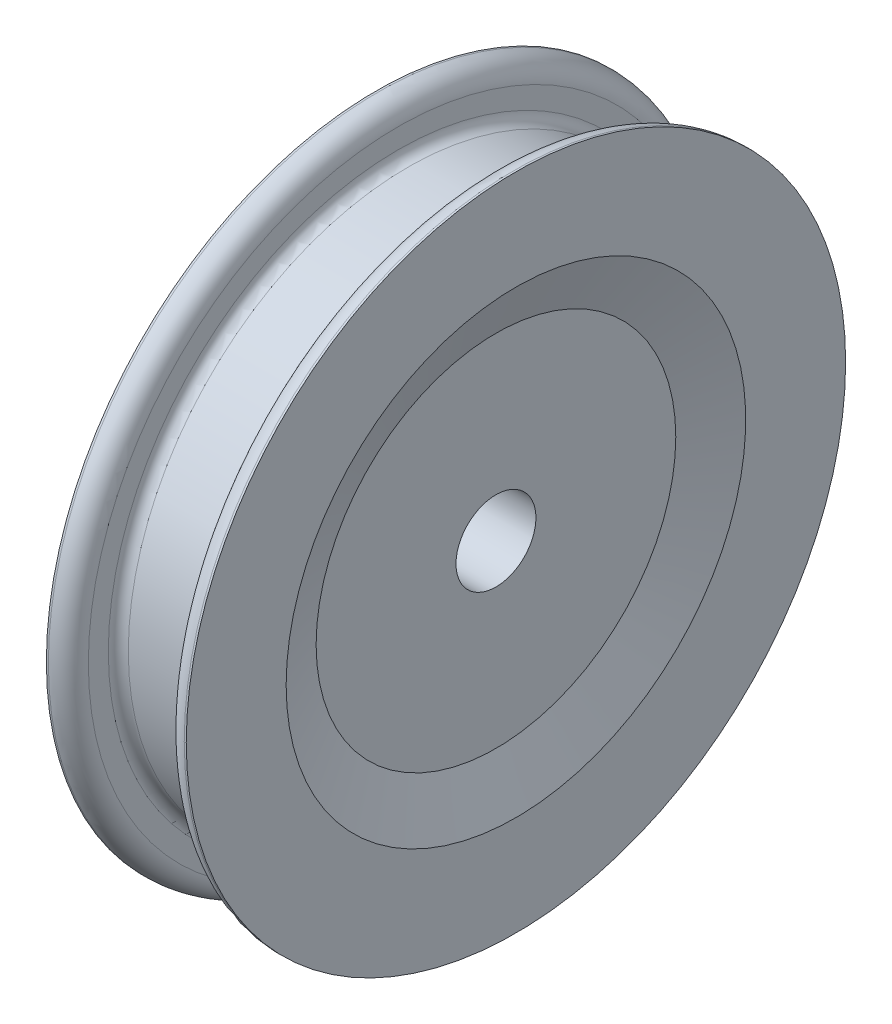
ISO-10303-21;
HEADER;
FILE_DESCRIPTION(('STEP AP214'),'2;1');
FILE_NAME('part.step','',(''),(''),'','','');
FILE_SCHEMA(('AUTOMOTIVE_DESIGN { 1 0 10303 214 1 1 1 1 }'));
ENDSEC;
DATA;
#1=APPLICATION_CONTEXT('core data for automotive mechanical design processes');
#2=APPLICATION_PROTOCOL_DEFINITION('international standard','automotive_design',2000,#1);
#3=PRODUCT_CONTEXT('',#1,'mechanical');
#4=PRODUCT('Part','Part','',(#3));
#5=PRODUCT_RELATED_PRODUCT_CATEGORY('part','',(#4));
#6=PRODUCT_DEFINITION_FORMATION('','',#4);
#7=PRODUCT_DEFINITION_CONTEXT('part definition',#1,'design');
#8=PRODUCT_DEFINITION('design','',#6,#7);
#9=PRODUCT_DEFINITION_SHAPE('','',#8);
#10=(LENGTH_UNIT() NAMED_UNIT(*) SI_UNIT(.MILLI.,.METRE.));
#11=(NAMED_UNIT(*) PLANE_ANGLE_UNIT() SI_UNIT($,.RADIAN.));
#12=(NAMED_UNIT(*) SI_UNIT($,.STERADIAN.) SOLID_ANGLE_UNIT());
#13=UNCERTAINTY_MEASURE_WITH_UNIT(LENGTH_MEASURE(1.E-05),#10,'distance_accuracy_value','');
#14=(GEOMETRIC_REPRESENTATION_CONTEXT(3) GLOBAL_UNCERTAINTY_ASSIGNED_CONTEXT((#13)) GLOBAL_UNIT_ASSIGNED_CONTEXT((#10,
#11,#12)) REPRESENTATION_CONTEXT('',''));
#15=CARTESIAN_POINT('',(0.,0.,0.));
#16=DIRECTION('',(0.,0.,1.));
#17=DIRECTION('',(1.,0.,0.));
#18=AXIS2_PLACEMENT_3D('',#15,#16,#17);
#19=CARTESIAN_POINT('',(0.,0.,0.));
#20=DIRECTION('',(-1.,0.,0.));
#21=DIRECTION('',(0.,0.,1.));
#22=AXIS2_PLACEMENT_3D('',#19,#20,#21);
#23=CYLINDRICAL_SURFACE('',#22,1.);
#24=CARTESIAN_POINT('',(1.25,0.,0.));
#25=DIRECTION('',(-1.,0.,0.));
#26=DIRECTION('',(0.,0.,1.));
#27=AXIS2_PLACEMENT_3D('',#24,#25,#26);
#28=CIRCLE('',#27,1.);
#29=CARTESIAN_POINT('',(1.25,0.,1.));
#30=VERTEX_POINT('',#29);
#31=EDGE_CURVE('E50',#30,#30,#28,.T.);
#32=ORIENTED_EDGE('',*,*,#31,.F.);
#33=EDGE_LOOP('',(#32));
#34=FACE_BOUND('',#33,.T.);
#35=CARTESIAN_POINT('',(-1.75,0.,0.));
#36=DIRECTION('',(-1.,0.,0.));
#37=DIRECTION('',(0.,0.,1.));
#38=AXIS2_PLACEMENT_3D('',#35,#36,#37);
#39=CIRCLE('',#38,1.);
#40=CARTESIAN_POINT('',(-1.75,0.,1.));
#41=VERTEX_POINT('',#40);
#42=EDGE_CURVE('E77',#41,#41,#39,.T.);
#43=ORIENTED_EDGE('',*,*,#42,.T.);
#44=EDGE_LOOP('',(#43));
#45=FACE_BOUND('',#44,.T.);
#46=ADVANCED_FACE('F30',(#34,#45),#23,.F.);
#47=CARTESIAN_POINT('',(1.25,4.5,0.));
#48=DIRECTION('',(-1.,0.,0.));
#49=DIRECTION('',(0.,0.,1.));
#50=AXIS2_PLACEMENT_3D('',#47,#48,#49);
#51=PLANE('',#50);
#52=CARTESIAN_POINT('',(1.25,0.,0.));
#53=DIRECTION('',(-1.,0.,0.));
#54=DIRECTION('',(0.,0.,1.));
#55=AXIS2_PLACEMENT_3D('',#52,#53,#54);
#56=CIRCLE('',#55,4.5);
#57=CARTESIAN_POINT('',(1.25,0.,4.5));
#58=VERTEX_POINT('',#57);
#59=EDGE_CURVE('E53',#58,#58,#56,.T.);
#60=ORIENTED_EDGE('',*,*,#59,.F.);
#61=EDGE_LOOP('',(#60));
#62=FACE_BOUND('',#61,.T.);
#63=ORIENTED_EDGE('',*,*,#31,.T.);
#64=EDGE_LOOP('',(#63));
#65=FACE_BOUND('',#64,.T.);
#66=ADVANCED_FACE('F101',(#62,#65),#51,.F.);
#67=CARTESIAN_POINT('',(1.25,0.,0.));
#68=DIRECTION('',(1.,0.,0.));
#69=DIRECTION('',(0.,0.,-1.));
#70=AXIS2_PLACEMENT_3D('',#67,#68,#69);
#71=CONICAL_SURFACE('',#70,4.5,1.19028994968253);
#72=CARTESIAN_POINT('',(1.75,0.,0.));
#73=DIRECTION('',(-1.,0.,0.));
#74=DIRECTION('',(0.,0.,1.));
#75=AXIS2_PLACEMENT_3D('',#72,#73,#74);
#76=CIRCLE('',#75,5.74999999999999);
#77=CARTESIAN_POINT('',(1.75,0.,5.74999999999999));
#78=VERTEX_POINT('',#77);
#79=EDGE_CURVE('E56',#78,#78,#76,.T.);
#80=ORIENTED_EDGE('',*,*,#79,.F.);
#81=EDGE_LOOP('',(#80));
#82=FACE_BOUND('',#81,.T.);
#83=ORIENTED_EDGE('',*,*,#59,.T.);
#84=EDGE_LOOP('',(#83));
#85=FACE_BOUND('',#84,.T.);
#86=ADVANCED_FACE('F107',(#82,#85),#71,.F.);
#87=CARTESIAN_POINT('',(1.75,8.24999999999999,0.));
#88=DIRECTION('',(-1.,0.,0.));
#89=DIRECTION('',(0.,0.,1.));
#90=AXIS2_PLACEMENT_3D('',#87,#88,#89);
#91=PLANE('',#90);
#92=CARTESIAN_POINT('',(1.75,0.,0.));
#93=DIRECTION('',(-1.,0.,0.));
#94=DIRECTION('',(0.,0.,1.));
#95=AXIS2_PLACEMENT_3D('',#92,#93,#94);
#96=CIRCLE('',#95,8.24999999999999);
#97=CARTESIAN_POINT('',(1.75,0.,8.24999999999999));
#98=VERTEX_POINT('',#97);
#99=EDGE_CURVE('E59',#98,#98,#96,.T.);
#100=ORIENTED_EDGE('',*,*,#99,.F.);
#101=EDGE_LOOP('',(#100));
#102=FACE_BOUND('',#101,.T.);
#103=ORIENTED_EDGE('',*,*,#79,.T.);
#104=EDGE_LOOP('',(#103));
#105=FACE_BOUND('',#104,.T.);
#106=ADVANCED_FACE('F148',(#102,#105),#91,.F.);
#107=CARTESIAN_POINT('',(0.,0.,0.));
#108=DIRECTION('',(-1.,0.,0.));
#109=DIRECTION('',(0.,0.,1.));
#110=AXIS2_PLACEMENT_3D('',#107,#108,#109);
#111=CYLINDRICAL_SURFACE('',#110,8.24999999999999);
#112=CARTESIAN_POINT('',(1.7,0.,0.));
#113=DIRECTION('',(1.,0.,0.));
#114=DIRECTION('',(0.,0.,-1.));
#115=AXIS2_PLACEMENT_3D('',#112,#113,#114);
#116=CIRCLE('',#115,8.24999999999999);
#117=CARTESIAN_POINT('',(1.7,0.,-8.24999999999999));
#118=VERTEX_POINT('',#117);
#119=EDGE_CURVE('E10',#118,#118,#116,.T.);
#120=ORIENTED_EDGE('',*,*,#119,.T.);
#121=EDGE_LOOP('',(#120));
#122=FACE_BOUND('',#121,.T.);
#123=ORIENTED_EDGE('',*,*,#99,.T.);
#124=EDGE_LOOP('',(#123));
#125=FACE_BOUND('',#124,.T.);
#126=ADVANCED_FACE('F143',(#122,#125),#111,.T.);
#127=CARTESIAN_POINT('',(1.2,8.24999999999999,0.));
#128=DIRECTION('',(1.,0.,0.));
#129=DIRECTION('',(0.,0.,-1.));
#130=AXIS2_PLACEMENT_3D('',#127,#128,#129);
#131=PLANE('',#130);
#132=CARTESIAN_POINT('',(1.2,0.,0.));
#133=DIRECTION('',(1.,0.,0.));
#134=DIRECTION('',(0.,0.,-1.));
#135=AXIS2_PLACEMENT_3D('',#132,#133,#134);
#136=CIRCLE('',#135,7.74999999999999);
#137=CARTESIAN_POINT('',(1.2,0.,-7.74999999999999));
#138=VERTEX_POINT('',#137);
#139=EDGE_CURVE('E37',#138,#138,#136,.F.);
#140=ORIENTED_EDGE('',*,*,#139,.T.);
#141=EDGE_LOOP('',(#140));
#142=FACE_BOUND('',#141,.T.);
#143=CARTESIAN_POINT('',(1.2,0.,0.));
#144=DIRECTION('',(-1.,0.,0.));
#145=DIRECTION('',(0.,0.,1.));
#146=AXIS2_PLACEMENT_3D('',#143,#144,#145);
#147=CIRCLE('',#146,7.25);
#148=CARTESIAN_POINT('',(1.2,0.,7.25));
#149=VERTEX_POINT('',#148);
#150=EDGE_CURVE('E62',#149,#149,#147,.T.);
#151=ORIENTED_EDGE('',*,*,#150,.F.);
#152=EDGE_LOOP('',(#151));
#153=FACE_BOUND('',#152,.T.);
#154=ADVANCED_FACE('F138',(#142,#153),#131,.F.);
#155=CARTESIAN_POINT('',(0.95,0.,0.));
#156=DIRECTION('',(-1.,0.,0.));
#157=DIRECTION('',(0.,0.,1.));
#158=AXIS2_PLACEMENT_3D('',#155,#156,#157);
#159=TOROIDAL_SURFACE('',#158,7.25,0.25);
#160=CARTESIAN_POINT('',(0.95,0.,0.));
#161=DIRECTION('',(-1.,0.,0.));
#162=DIRECTION('',(0.,0.,1.));
#163=AXIS2_PLACEMENT_3D('',#160,#161,#162);
#164=CIRCLE('',#163,7.);
#165=CARTESIAN_POINT('',(0.95,0.,7.));
#166=VERTEX_POINT('',#165);
#167=EDGE_CURVE('E65',#166,#166,#164,.T.);
#168=ORIENTED_EDGE('',*,*,#167,.F.);
#169=EDGE_LOOP('',(#168));
#170=FACE_BOUND('',#169,.T.);
#171=ORIENTED_EDGE('',*,*,#150,.T.);
#172=EDGE_LOOP('',(#171));
#173=FACE_BOUND('',#172,.T.);
#174=ADVANCED_FACE('F132',(#170,#173),#159,.F.);
#175=CARTESIAN_POINT('',(0.,0.,0.));
#176=DIRECTION('',(-1.,0.,0.));
#177=DIRECTION('',(0.,0.,1.));
#178=AXIS2_PLACEMENT_3D('',#175,#176,#177);
#179=CYLINDRICAL_SURFACE('',#178,7.);
#180=CARTESIAN_POINT('',(-0.95,0.,0.));
#181=DIRECTION('',(-1.,0.,0.));
#182=DIRECTION('',(0.,0.,1.));
#183=AXIS2_PLACEMENT_3D('',#180,#181,#182);
#184=CIRCLE('',#183,7.);
#185=CARTESIAN_POINT('',(-0.95,0.,7.));
#186=VERTEX_POINT('',#185);
#187=EDGE_CURVE('E68',#186,#186,#184,.T.);
#188=ORIENTED_EDGE('',*,*,#187,.F.);
#189=EDGE_LOOP('',(#188));
#190=FACE_BOUND('',#189,.T.);
#191=ORIENTED_EDGE('',*,*,#167,.T.);
#192=EDGE_LOOP('',(#191));
#193=FACE_BOUND('',#192,.T.);
#194=ADVANCED_FACE('F126',(#190,#193),#179,.T.);
#195=CARTESIAN_POINT('',(-0.95,0.,0.));
#196=DIRECTION('',(-1.,0.,0.));
#197=DIRECTION('',(0.,0.,1.));
#198=AXIS2_PLACEMENT_3D('',#195,#196,#197);
#199=TOROIDAL_SURFACE('',#198,7.25,0.25);
#200=CARTESIAN_POINT('',(-1.2,0.,0.));
#201=DIRECTION('',(-1.,0.,0.));
#202=DIRECTION('',(0.,0.,1.));
#203=AXIS2_PLACEMENT_3D('',#200,#201,#202);
#204=CIRCLE('',#203,7.25);
#205=CARTESIAN_POINT('',(-1.2,0.,7.25));
#206=VERTEX_POINT('',#205);
#207=EDGE_CURVE('E71',#206,#206,#204,.T.);
#208=ORIENTED_EDGE('',*,*,#207,.F.);
#209=EDGE_LOOP('',(#208));
#210=FACE_BOUND('',#209,.T.);
#211=ORIENTED_EDGE('',*,*,#187,.T.);
#212=EDGE_LOOP('',(#211));
#213=FACE_BOUND('',#212,.T.);
#214=ADVANCED_FACE('F97',(#210,#213),#199,.F.);
#215=CARTESIAN_POINT('',(-1.2,8.24999999999999,0.));
#216=DIRECTION('',(-1.,0.,0.));
#217=DIRECTION('',(0.,0.,1.));
#218=AXIS2_PLACEMENT_3D('',#215,#216,#217);
#219=PLANE('',#218);
#220=CARTESIAN_POINT('',(-1.2,0.,0.));
#221=DIRECTION('',(-1.,0.,0.));
#222=DIRECTION('',(0.,0.,1.));
#223=AXIS2_PLACEMENT_3D('',#220,#221,#222);
#224=CIRCLE('',#223,7.74999999999999);
#225=CARTESIAN_POINT('',(-1.2,0.,7.74999999999999));
#226=VERTEX_POINT('',#225);
#227=EDGE_CURVE('E41',#226,#226,#224,.F.);
#228=ORIENTED_EDGE('',*,*,#227,.T.);
#229=EDGE_LOOP('',(#228));
#230=FACE_BOUND('',#229,.T.);
#231=ORIENTED_EDGE('',*,*,#207,.T.);
#232=EDGE_LOOP('',(#231));
#233=FACE_BOUND('',#232,.T.);
#234=ADVANCED_FACE('F91',(#230,#233),#219,.F.);
#235=CARTESIAN_POINT('',(0.,0.,0.));
#236=DIRECTION('',(-1.,0.,0.));
#237=DIRECTION('',(0.,0.,1.));
#238=AXIS2_PLACEMENT_3D('',#235,#236,#237);
#239=CYLINDRICAL_SURFACE('',#238,8.24999999999999);
#240=CARTESIAN_POINT('',(-1.7,0.,0.));
#241=DIRECTION('',(-1.,0.,0.));
#242=DIRECTION('',(0.,0.,1.));
#243=AXIS2_PLACEMENT_3D('',#240,#241,#242);
#244=CIRCLE('',#243,8.24999999999999);
#245=CARTESIAN_POINT('',(-1.7,0.,8.24999999999999));
#246=VERTEX_POINT('',#245);
#247=EDGE_CURVE('E45',#246,#246,#244,.T.);
#248=ORIENTED_EDGE('',*,*,#247,.T.);
#249=EDGE_LOOP('',(#248));
#250=FACE_BOUND('',#249,.T.);
#251=CARTESIAN_POINT('',(-1.75,0.,0.));
#252=DIRECTION('',(-1.,0.,0.));
#253=DIRECTION('',(0.,0.,1.));
#254=AXIS2_PLACEMENT_3D('',#251,#252,#253);
#255=CIRCLE('',#254,8.24999999999999);
#256=CARTESIAN_POINT('',(-1.75,0.,8.24999999999999));
#257=VERTEX_POINT('',#256);
#258=EDGE_CURVE('E74',#257,#257,#255,.T.);
#259=ORIENTED_EDGE('',*,*,#258,.F.);
#260=EDGE_LOOP('',(#259));
#261=FACE_BOUND('',#260,.T.);
#262=ADVANCED_FACE('F86',(#250,#261),#239,.T.);
#263=CARTESIAN_POINT('',(-1.75,8.24999999999999,0.));
#264=DIRECTION('',(1.,0.,0.));
#265=DIRECTION('',(0.,0.,-1.));
#266=AXIS2_PLACEMENT_3D('',#263,#264,#265);
#267=PLANE('',#266);
#268=ORIENTED_EDGE('',*,*,#42,.F.);
#269=EDGE_LOOP('',(#268));
#270=FACE_BOUND('',#269,.T.);
#271=ORIENTED_EDGE('',*,*,#258,.T.);
#272=EDGE_LOOP('',(#271));
#273=FACE_BOUND('',#272,.T.);
#274=ADVANCED_FACE('F82',(#270,#273),#267,.F.);
#275=CARTESIAN_POINT('',(-1.7,0.,0.));
#276=DIRECTION('',(-1.,0.,0.));
#277=DIRECTION('',(0.,0.,1.));
#278=AXIS2_PLACEMENT_3D('',#275,#276,#277);
#279=TOROIDAL_SURFACE('',#278,7.74999999999999,0.5);
#280=ORIENTED_EDGE('',*,*,#227,.F.);
#281=EDGE_LOOP('',(#280));
#282=FACE_BOUND('',#281,.T.);
#283=ORIENTED_EDGE('',*,*,#247,.F.);
#284=EDGE_LOOP('',(#283));
#285=FACE_BOUND('',#284,.T.);
#286=ADVANCED_FACE('F85',(#282,#285),#279,.T.);
#287=CARTESIAN_POINT('',(1.7,0.,0.));
#288=DIRECTION('',(1.,0.,0.));
#289=DIRECTION('',(0.,0.,-1.));
#290=AXIS2_PLACEMENT_3D('',#287,#288,#289);
#291=TOROIDAL_SURFACE('',#290,7.74999999999999,0.5);
#292=ORIENTED_EDGE('',*,*,#119,.F.);
#293=EDGE_LOOP('',(#292));
#294=FACE_BOUND('',#293,.T.);
#295=ORIENTED_EDGE('',*,*,#139,.F.);
#296=EDGE_LOOP('',(#295));
#297=FACE_BOUND('',#296,.T.);
#298=ADVANCED_FACE('F32',(#294,#297),#291,.T.);
#299=CLOSED_SHELL('',(#46,#66,#86,#106,#126,#154,#174,#194,#214,#234,#262,#274,#286,#298));
#300=MANIFOLD_SOLID_BREP('B2',#299);
#301=ADVANCED_BREP_SHAPE_REPRESENTATION('',(#18,#300),#14);
#302=SHAPE_DEFINITION_REPRESENTATION(#9,#301);
ENDSEC;
END-ISO-10303-21;
